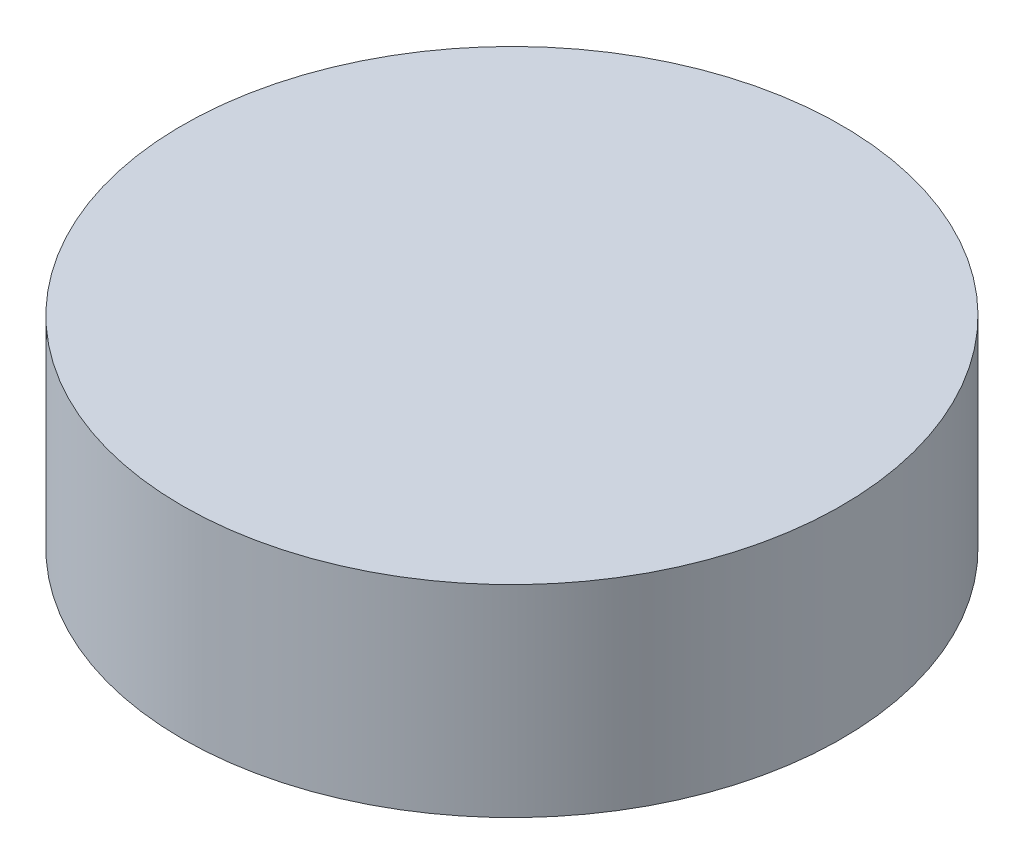
ISO-10303-21;
HEADER;
FILE_DESCRIPTION(('STEP AP214'),'2;1');
FILE_NAME('part.step','',(''),(''),'','','');
FILE_SCHEMA(('AUTOMOTIVE_DESIGN { 1 0 10303 214 1 1 1 1 }'));
ENDSEC;
DATA;
#1=APPLICATION_CONTEXT('core data for automotive mechanical design processes');
#2=APPLICATION_PROTOCOL_DEFINITION('international standard','automotive_design',2000,#1);
#3=PRODUCT_CONTEXT('',#1,'mechanical');
#4=PRODUCT('Part','Part','',(#3));
#5=PRODUCT_RELATED_PRODUCT_CATEGORY('part','',(#4));
#6=PRODUCT_DEFINITION_FORMATION('','',#4);
#7=PRODUCT_DEFINITION_CONTEXT('part definition',#1,'design');
#8=PRODUCT_DEFINITION('design','',#6,#7);
#9=PRODUCT_DEFINITION_SHAPE('','',#8);
#10=(LENGTH_UNIT() NAMED_UNIT(*) SI_UNIT(.MILLI.,.METRE.));
#11=(NAMED_UNIT(*) PLANE_ANGLE_UNIT() SI_UNIT($,.RADIAN.));
#12=(NAMED_UNIT(*) SI_UNIT($,.STERADIAN.) SOLID_ANGLE_UNIT());
#13=UNCERTAINTY_MEASURE_WITH_UNIT(LENGTH_MEASURE(1.E-05),#10,'distance_accuracy_value','');
#14=(GEOMETRIC_REPRESENTATION_CONTEXT(3) GLOBAL_UNCERTAINTY_ASSIGNED_CONTEXT((#13)) GLOBAL_UNIT_ASSIGNED_CONTEXT((#10,
#11,#12)) REPRESENTATION_CONTEXT('',''));
#15=CARTESIAN_POINT('',(0.,0.,0.));
#16=DIRECTION('',(0.,0.,1.));
#17=DIRECTION('',(1.,0.,0.));
#18=AXIS2_PLACEMENT_3D('',#15,#16,#17);
#19=CARTESIAN_POINT('',(0.,30.,0.));
#20=DIRECTION('',(0.,-1.,0.));
#21=DIRECTION('',(0.,0.,-1.));
#22=AXIS2_PLACEMENT_3D('',#19,#20,#21);
#23=CYLINDRICAL_SURFACE('',#22,49.);
#24=CARTESIAN_POINT('',(0.,30.,0.));
#25=DIRECTION('',(0.,1.,0.));
#26=DIRECTION('',(0.,0.,1.));
#27=AXIS2_PLACEMENT_3D('',#24,#25,#26);
#28=CIRCLE('',#27,49.);
#29=CARTESIAN_POINT('',(0.,30.,49.));
#30=VERTEX_POINT('',#29);
#31=EDGE_CURVE('E10',#30,#30,#28,.T.);
#32=ORIENTED_EDGE('',*,*,#31,.F.);
#33=EDGE_LOOP('',(#32));
#34=FACE_BOUND('',#33,.T.);
#35=CARTESIAN_POINT('',(0.,0.,0.));
#36=DIRECTION('',(0.,1.,0.));
#37=DIRECTION('',(0.,0.,1.));
#38=AXIS2_PLACEMENT_3D('',#35,#36,#37);
#39=CIRCLE('',#38,49.);
#40=CARTESIAN_POINT('',(0.,0.,49.));
#41=VERTEX_POINT('',#40);
#42=EDGE_CURVE('E40',#41,#41,#39,.T.);
#43=ORIENTED_EDGE('',*,*,#42,.T.);
#44=EDGE_LOOP('',(#43));
#45=FACE_BOUND('',#44,.T.);
#46=ADVANCED_FACE('F37',(#34,#45),#23,.T.);
#47=CARTESIAN_POINT('',(0.,30.,0.));
#48=DIRECTION('',(0.,1.,0.));
#49=DIRECTION('',(0.,0.,1.));
#50=AXIS2_PLACEMENT_3D('',#47,#48,#49);
#51=PLANE('',#50);
#52=ORIENTED_EDGE('',*,*,#31,.T.);
#53=EDGE_LOOP('',(#52));
#54=FACE_BOUND('',#53,.T.);
#55=ADVANCED_FACE('F54',(#54),#51,.T.);
#56=CARTESIAN_POINT('',(0.,0.,0.));
#57=DIRECTION('',(0.,1.,0.));
#58=DIRECTION('',(0.,0.,1.));
#59=AXIS2_PLACEMENT_3D('',#56,#57,#58);
#60=PLANE('',#59);
#61=ORIENTED_EDGE('',*,*,#42,.F.);
#62=EDGE_LOOP('',(#61));
#63=FACE_BOUND('',#62,.T.);
#64=ADVANCED_FACE('F52',(#63),#60,.F.);
#65=CLOSED_SHELL('',(#46,#55,#64));
#66=MANIFOLD_SOLID_BREP('B2',#65);
#67=ADVANCED_BREP_SHAPE_REPRESENTATION('',(#18,#66),#14);
#68=SHAPE_DEFINITION_REPRESENTATION(#9,#67);
ENDSEC;
END-ISO-10303-21;
